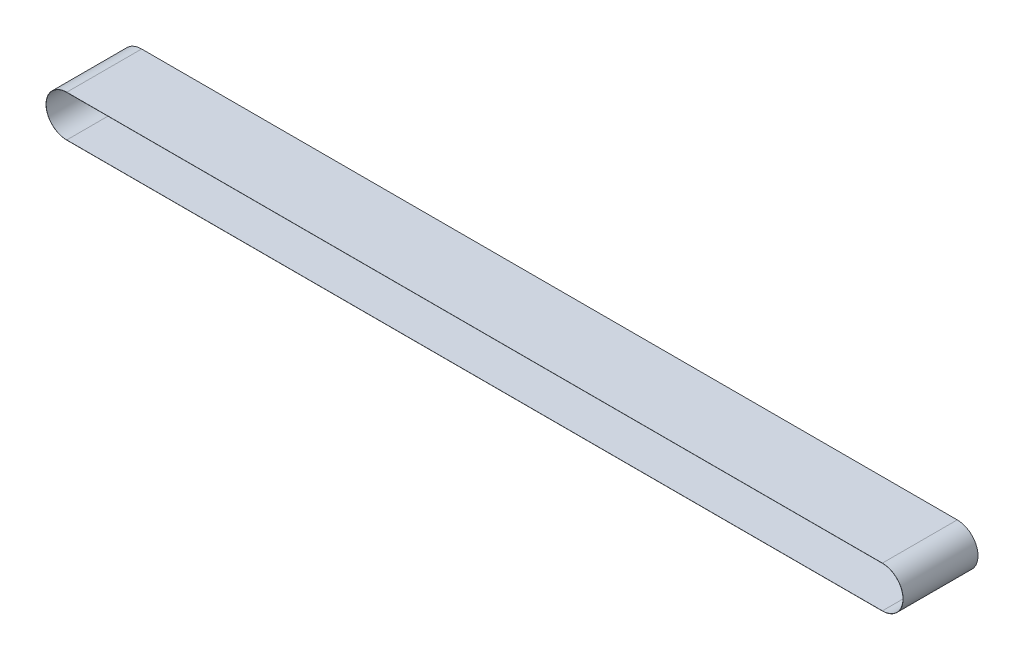
ISO-10303-21;
HEADER;
FILE_DESCRIPTION(('STEP AP214'),'2;1');
FILE_NAME('part.step','',(''),(''),'','','');
FILE_SCHEMA(('AUTOMOTIVE_DESIGN { 1 0 10303 214 1 1 1 1 }'));
ENDSEC;
DATA;
#1=APPLICATION_CONTEXT('core data for automotive mechanical design processes');
#2=APPLICATION_PROTOCOL_DEFINITION('international standard','automotive_design',2000,#1);
#3=PRODUCT_CONTEXT('',#1,'mechanical');
#4=PRODUCT('Part','Part','',(#3));
#5=PRODUCT_RELATED_PRODUCT_CATEGORY('part','',(#4));
#6=PRODUCT_DEFINITION_FORMATION('','',#4);
#7=PRODUCT_DEFINITION_CONTEXT('part definition',#1,'design');
#8=PRODUCT_DEFINITION('design','',#6,#7);
#9=PRODUCT_DEFINITION_SHAPE('','',#8);
#10=(LENGTH_UNIT() NAMED_UNIT(*) SI_UNIT(.MILLI.,.METRE.));
#11=(NAMED_UNIT(*) PLANE_ANGLE_UNIT() SI_UNIT($,.RADIAN.));
#12=(NAMED_UNIT(*) SI_UNIT($,.STERADIAN.) SOLID_ANGLE_UNIT());
#13=UNCERTAINTY_MEASURE_WITH_UNIT(LENGTH_MEASURE(1.E-05),#10,'distance_accuracy_value','');
#14=(GEOMETRIC_REPRESENTATION_CONTEXT(3) GLOBAL_UNCERTAINTY_ASSIGNED_CONTEXT((#13)) GLOBAL_UNIT_ASSIGNED_CONTEXT((#10,
#11,#12)) REPRESENTATION_CONTEXT('',''));
#15=CARTESIAN_POINT('',(0.,0.,0.));
#16=DIRECTION('',(0.,0.,1.));
#17=DIRECTION('',(1.,0.,0.));
#18=AXIS2_PLACEMENT_3D('',#15,#16,#17);
#19=CARTESIAN_POINT('',(272.300004366792,0.,-25.));
#20=DIRECTION('',(0.,0.,1.));
#21=DIRECTION('',(1.,0.,0.));
#22=AXIS2_PLACEMENT_3D('',#19,#20,#21);
#23=CYLINDRICAL_SURFACE('',#22,13.8550000000007);
#24=DIRECTION('',(0.,0.,1.));
#25=VECTOR('',#24,1.);
#26=CARTESIAN_POINT('',(272.3,13.855,-25.));
#27=LINE('',#26,#25);
#28=CARTESIAN_POINT('',(272.3,13.855,-25.));
#29=VERTEX_POINT('',#28);
#30=CARTESIAN_POINT('',(272.3,13.855,25.));
#31=VERTEX_POINT('',#30);
#32=EDGE_CURVE('E90',#29,#31,#27,.T.);
#33=ORIENTED_EDGE('',*,*,#32,.T.);
#34=CARTESIAN_POINT('',(272.300004366792,0.,25.));
#35=DIRECTION('',(0.,0.,1.));
#36=DIRECTION('',(1.,0.,0.));
#37=AXIS2_PLACEMENT_3D('',#34,#35,#36);
#38=CIRCLE('',#37,13.8550000000007);
#39=CARTESIAN_POINT('',(272.3,-13.855,25.));
#40=VERTEX_POINT('',#39);
#41=EDGE_CURVE('E182',#40,#31,#38,.T.);
#42=ORIENTED_EDGE('',*,*,#41,.F.);
#43=DIRECTION('',(0.,0.,1.));
#44=VECTOR('',#43,1.);
#45=CARTESIAN_POINT('',(272.3,-13.855,-25.));
#46=LINE('',#45,#44);
#47=CARTESIAN_POINT('',(272.3,-13.855,-25.));
#48=VERTEX_POINT('',#47);
#49=EDGE_CURVE('E12',#48,#40,#46,.T.);
#50=ORIENTED_EDGE('',*,*,#49,.F.);
#51=CARTESIAN_POINT('',(272.300004366792,0.,-25.));
#52=DIRECTION('',(0.,0.,1.));
#53=DIRECTION('',(1.,0.,0.));
#54=AXIS2_PLACEMENT_3D('',#51,#52,#53);
#55=CIRCLE('',#54,13.8550000000007);
#56=EDGE_CURVE('E201',#48,#29,#55,.T.);
#57=ORIENTED_EDGE('',*,*,#56,.T.);
#58=EDGE_LOOP('',(#33,#42,#50,#57));
#59=FACE_BOUND('',#58,.T.);
#60=ADVANCED_FACE('F87',(#59),#23,.T.);
#61=CARTESIAN_POINT('',(-272.3,-13.855,-25.));
#62=DIRECTION('',(0.,-1.,0.));
#63=DIRECTION('',(0.,0.,-1.));
#64=AXIS2_PLACEMENT_3D('',#61,#62,#63);
#65=PLANE('',#64);
#66=ORIENTED_EDGE('',*,*,#49,.T.);
#67=DIRECTION('',(1.,0.,0.));
#68=VECTOR('',#67,1.);
#69=CARTESIAN_POINT('',(-272.3,-13.855,25.));
#70=LINE('',#69,#68);
#71=CARTESIAN_POINT('',(-272.299999968253,-13.855,25.));
#72=VERTEX_POINT('',#71);
#73=EDGE_CURVE('E191',#72,#40,#70,.T.);
#74=ORIENTED_EDGE('',*,*,#73,.F.);
#75=DIRECTION('',(0.,0.,1.));
#76=VECTOR('',#75,1.);
#77=CARTESIAN_POINT('',(-272.299999968253,-13.855,-25.));
#78=LINE('',#77,#76);
#79=CARTESIAN_POINT('',(-272.299999968253,-13.855,-25.));
#80=VERTEX_POINT('',#79);
#81=EDGE_CURVE('E95',#80,#72,#78,.T.);
#82=ORIENTED_EDGE('',*,*,#81,.F.);
#83=DIRECTION('',(1.,0.,0.));
#84=VECTOR('',#83,1.);
#85=CARTESIAN_POINT('',(-272.3,-13.855,-25.));
#86=LINE('',#85,#84);
#87=EDGE_CURVE('E212',#80,#48,#86,.T.);
#88=ORIENTED_EDGE('',*,*,#87,.T.);
#89=EDGE_LOOP('',(#66,#74,#82,#88));
#90=FACE_BOUND('',#89,.T.);
#91=ADVANCED_FACE('F224',(#90),#65,.T.);
#92=CARTESIAN_POINT('',(-272.300004366792,0.,-25.));
#93=DIRECTION('',(0.,0.,1.));
#94=DIRECTION('',(1.,0.,0.));
#95=AXIS2_PLACEMENT_3D('',#92,#93,#94);
#96=CYLINDRICAL_SURFACE('',#95,13.8550000000007);
#97=ORIENTED_EDGE('',*,*,#81,.T.);
#98=CARTESIAN_POINT('',(-272.300004366792,0.,25.));
#99=DIRECTION('',(0.,0.,1.));
#100=DIRECTION('',(1.,0.,0.));
#101=AXIS2_PLACEMENT_3D('',#98,#99,#100);
#102=CIRCLE('',#101,13.8550000000007);
#103=CARTESIAN_POINT('',(-272.3,13.855,25.));
#104=VERTEX_POINT('',#103);
#105=EDGE_CURVE('E188',#104,#72,#102,.T.);
#106=ORIENTED_EDGE('',*,*,#105,.F.);
#107=DIRECTION('',(0.,0.,1.));
#108=VECTOR('',#107,1.);
#109=CARTESIAN_POINT('',(-272.3,13.855,-25.));
#110=LINE('',#109,#108);
#111=CARTESIAN_POINT('',(-272.3,13.855,-25.));
#112=VERTEX_POINT('',#111);
#113=EDGE_CURVE('E215',#112,#104,#110,.T.);
#114=ORIENTED_EDGE('',*,*,#113,.F.);
#115=CARTESIAN_POINT('',(-272.300004366792,0.,-25.));
#116=DIRECTION('',(0.,0.,1.));
#117=DIRECTION('',(1.,0.,0.));
#118=AXIS2_PLACEMENT_3D('',#115,#116,#117);
#119=CIRCLE('',#118,13.8550000000007);
#120=EDGE_CURVE('E209',#112,#80,#119,.T.);
#121=ORIENTED_EDGE('',*,*,#120,.T.);
#122=EDGE_LOOP('',(#97,#106,#114,#121));
#123=FACE_BOUND('',#122,.T.);
#124=ADVANCED_FACE('F230',(#123),#96,.T.);
#125=CARTESIAN_POINT('',(-272.3,13.855,-25.));
#126=DIRECTION('',(0.,1.,0.));
#127=DIRECTION('',(0.,0.,1.));
#128=AXIS2_PLACEMENT_3D('',#125,#126,#127);
#129=PLANE('',#128);
#130=ORIENTED_EDGE('',*,*,#113,.T.);
#131=DIRECTION('',(-1.,0.,0.));
#132=VECTOR('',#131,1.);
#133=CARTESIAN_POINT('',(-272.3,13.855,25.));
#134=LINE('',#133,#132);
#135=EDGE_CURVE('E185',#31,#104,#134,.T.);
#136=ORIENTED_EDGE('',*,*,#135,.F.);
#137=ORIENTED_EDGE('',*,*,#32,.F.);
#138=DIRECTION('',(-1.,0.,0.));
#139=VECTOR('',#138,1.);
#140=CARTESIAN_POINT('',(-272.3,13.855,-25.));
#141=LINE('',#140,#139);
#142=EDGE_CURVE('E206',#29,#112,#141,.T.);
#143=ORIENTED_EDGE('',*,*,#142,.T.);
#144=EDGE_LOOP('',(#130,#136,#137,#143));
#145=FACE_BOUND('',#144,.T.);
#146=ADVANCED_FACE('F219',(#145),#129,.T.);
#147=CARTESIAN_POINT('',(272.300004366792,0.,-25.));
#148=DIRECTION('',(0.,0.,1.));
#149=DIRECTION('',(1.,0.,0.));
#150=AXIS2_PLACEMENT_3D('',#147,#148,#149);
#151=PLANE('',#150);
#152=DIRECTION('',(1.,0.,0.));
#153=VECTOR('',#152,1.);
#154=CARTESIAN_POINT('',(-272.3,-13.755,-25.));
#155=LINE('',#154,#153);
#156=CARTESIAN_POINT('',(-272.3,-13.755,-25.));
#157=VERTEX_POINT('',#156);
#158=CARTESIAN_POINT('',(272.3,-13.755,-25.));
#159=VERTEX_POINT('',#158);
#160=EDGE_CURVE('E164',#157,#159,#155,.T.);
#161=ORIENTED_EDGE('',*,*,#160,.T.);
#162=CARTESIAN_POINT('',(272.300004366792,0.,-25.));
#163=DIRECTION('',(0.,0.,1.));
#164=DIRECTION('',(1.,0.,0.));
#165=AXIS2_PLACEMENT_3D('',#162,#163,#164);
#166=CIRCLE('',#165,13.7550000000007);
#167=CARTESIAN_POINT('',(272.3,13.755,-25.));
#168=VERTEX_POINT('',#167);
#169=EDGE_CURVE('E194',#159,#168,#166,.T.);
#170=ORIENTED_EDGE('',*,*,#169,.T.);
#171=DIRECTION('',(-1.,0.,0.));
#172=VECTOR('',#171,1.);
#173=CARTESIAN_POINT('',(-272.3,13.755,-25.));
#174=LINE('',#173,#172);
#175=CARTESIAN_POINT('',(-272.3,13.755,-25.));
#176=VERTEX_POINT('',#175);
#177=EDGE_CURVE('E159',#168,#176,#174,.T.);
#178=ORIENTED_EDGE('',*,*,#177,.T.);
#179=CARTESIAN_POINT('',(-272.300004366792,0.,-25.));
#180=DIRECTION('',(0.,0.,1.));
#181=DIRECTION('',(-1.,0.,0.));
#182=AXIS2_PLACEMENT_3D('',#179,#180,#181);
#183=CIRCLE('',#182,13.7550000000007);
#184=EDGE_CURVE('E103',#176,#157,#183,.T.);
#185=ORIENTED_EDGE('',*,*,#184,.T.);
#186=EDGE_LOOP('',(#161,#170,#178,#185));
#187=FACE_BOUND('',#186,.T.);
#188=ORIENTED_EDGE('',*,*,#56,.F.);
#189=ORIENTED_EDGE('',*,*,#87,.F.);
#190=ORIENTED_EDGE('',*,*,#120,.F.);
#191=ORIENTED_EDGE('',*,*,#142,.F.);
#192=EDGE_LOOP('',(#188,#189,#190,#191));
#193=FACE_BOUND('',#192,.T.);
#194=ADVANCED_FACE('F228',(#187,#193),#151,.F.);
#195=CARTESIAN_POINT('',(272.300004366792,0.,-25.));
#196=DIRECTION('',(0.,0.,1.));
#197=DIRECTION('',(1.,0.,0.));
#198=AXIS2_PLACEMENT_3D('',#195,#196,#197);
#199=CYLINDRICAL_SURFACE('',#198,13.7550000000007);
#200=DIRECTION('',(0.,0.,1.));
#201=VECTOR('',#200,1.);
#202=CARTESIAN_POINT('',(272.3,-13.755,-25.));
#203=LINE('',#202,#201);
#204=CARTESIAN_POINT('',(272.3,-13.755,25.));
#205=VERTEX_POINT('',#204);
#206=EDGE_CURVE('E169',#159,#205,#203,.T.);
#207=ORIENTED_EDGE('',*,*,#206,.T.);
#208=CARTESIAN_POINT('',(272.300004366792,0.,25.));
#209=DIRECTION('',(0.,0.,1.));
#210=DIRECTION('',(1.,0.,0.));
#211=AXIS2_PLACEMENT_3D('',#208,#209,#210);
#212=CIRCLE('',#211,13.7550000000007);
#213=CARTESIAN_POINT('',(272.3,13.755,25.));
#214=VERTEX_POINT('',#213);
#215=EDGE_CURVE('E167',#205,#214,#212,.T.);
#216=ORIENTED_EDGE('',*,*,#215,.T.);
#217=DIRECTION('',(0.,0.,1.));
#218=VECTOR('',#217,1.);
#219=CARTESIAN_POINT('',(272.3,13.755,-25.));
#220=LINE('',#219,#218);
#221=EDGE_CURVE('E152',#168,#214,#220,.T.);
#222=ORIENTED_EDGE('',*,*,#221,.F.);
#223=ORIENTED_EDGE('',*,*,#169,.F.);
#224=EDGE_LOOP('',(#207,#216,#222,#223));
#225=FACE_BOUND('',#224,.T.);
#226=ADVANCED_FACE('F168',(#225),#199,.F.);
#227=CARTESIAN_POINT('',(-272.3,-13.755,-25.));
#228=DIRECTION('',(0.,-1.,0.));
#229=DIRECTION('',(0.,0.,-1.));
#230=AXIS2_PLACEMENT_3D('',#227,#228,#229);
#231=PLANE('',#230);
#232=DIRECTION('',(0.,0.,1.));
#233=VECTOR('',#232,1.);
#234=CARTESIAN_POINT('',(-272.3,-13.755,-25.));
#235=LINE('',#234,#233);
#236=CARTESIAN_POINT('',(-272.3,-13.755,25.));
#237=VERTEX_POINT('',#236);
#238=EDGE_CURVE('E202',#157,#237,#235,.T.);
#239=ORIENTED_EDGE('',*,*,#238,.T.);
#240=DIRECTION('',(1.,0.,0.));
#241=VECTOR('',#240,1.);
#242=CARTESIAN_POINT('',(-272.3,-13.755,25.));
#243=LINE('',#242,#241);
#244=EDGE_CURVE('E178',#237,#205,#243,.T.);
#245=ORIENTED_EDGE('',*,*,#244,.T.);
#246=ORIENTED_EDGE('',*,*,#206,.F.);
#247=ORIENTED_EDGE('',*,*,#160,.F.);
#248=EDGE_LOOP('',(#239,#245,#246,#247));
#249=FACE_BOUND('',#248,.T.);
#250=ADVANCED_FACE('F275',(#249),#231,.F.);
#251=CARTESIAN_POINT('',(-272.300004366792,0.,-25.));
#252=DIRECTION('',(0.,0.,1.));
#253=DIRECTION('',(1.,0.,0.));
#254=AXIS2_PLACEMENT_3D('',#251,#252,#253);
#255=CYLINDRICAL_SURFACE('',#254,13.7550000000007);
#256=DIRECTION('',(0.,0.,1.));
#257=VECTOR('',#256,1.);
#258=CARTESIAN_POINT('',(-272.3,13.755,-25.));
#259=LINE('',#258,#257);
#260=CARTESIAN_POINT('',(-272.3,13.755,25.));
#261=VERTEX_POINT('',#260);
#262=EDGE_CURVE('E163',#176,#261,#259,.T.);
#263=ORIENTED_EDGE('',*,*,#262,.T.);
#264=CARTESIAN_POINT('',(-272.300004366792,0.,25.));
#265=DIRECTION('',(0.,0.,1.));
#266=DIRECTION('',(-1.,0.,0.));
#267=AXIS2_PLACEMENT_3D('',#264,#265,#266);
#268=CIRCLE('',#267,13.7550000000007);
#269=EDGE_CURVE('E176',#261,#237,#268,.T.);
#270=ORIENTED_EDGE('',*,*,#269,.T.);
#271=ORIENTED_EDGE('',*,*,#238,.F.);
#272=ORIENTED_EDGE('',*,*,#184,.F.);
#273=EDGE_LOOP('',(#263,#270,#271,#272));
#274=FACE_BOUND('',#273,.T.);
#275=ADVANCED_FACE('F284',(#274),#255,.F.);
#276=CARTESIAN_POINT('',(-272.3,13.755,-25.));
#277=DIRECTION('',(0.,1.,0.));
#278=DIRECTION('',(0.,0.,1.));
#279=AXIS2_PLACEMENT_3D('',#276,#277,#278);
#280=PLANE('',#279);
#281=ORIENTED_EDGE('',*,*,#221,.T.);
#282=DIRECTION('',(-1.,0.,0.));
#283=VECTOR('',#282,1.);
#284=CARTESIAN_POINT('',(-272.3,13.755,25.));
#285=LINE('',#284,#283);
#286=EDGE_CURVE('E156',#214,#261,#285,.T.);
#287=ORIENTED_EDGE('',*,*,#286,.T.);
#288=ORIENTED_EDGE('',*,*,#262,.F.);
#289=ORIENTED_EDGE('',*,*,#177,.F.);
#290=EDGE_LOOP('',(#281,#287,#288,#289));
#291=FACE_BOUND('',#290,.T.);
#292=ADVANCED_FACE('F154',(#291),#280,.F.);
#293=CARTESIAN_POINT('',(272.300004366792,0.,25.));
#294=DIRECTION('',(0.,0.,1.));
#295=DIRECTION('',(1.,0.,0.));
#296=AXIS2_PLACEMENT_3D('',#293,#294,#295);
#297=PLANE('',#296);
#298=ORIENTED_EDGE('',*,*,#41,.T.);
#299=ORIENTED_EDGE('',*,*,#135,.T.);
#300=ORIENTED_EDGE('',*,*,#105,.T.);
#301=ORIENTED_EDGE('',*,*,#73,.T.);
#302=EDGE_LOOP('',(#298,#299,#300,#301));
#303=FACE_BOUND('',#302,.T.);
#304=ORIENTED_EDGE('',*,*,#286,.F.);
#305=ORIENTED_EDGE('',*,*,#215,.F.);
#306=ORIENTED_EDGE('',*,*,#244,.F.);
#307=ORIENTED_EDGE('',*,*,#269,.F.);
#308=EDGE_LOOP('',(#304,#305,#306,#307));
#309=FACE_BOUND('',#308,.T.);
#310=ADVANCED_FACE('F174',(#303,#309),#297,.T.);
#311=CLOSED_SHELL('',(#60,#91,#124,#146,#194,#226,#250,#275,#292,#310));
#312=MANIFOLD_SOLID_BREP('B2',#311);
#313=ADVANCED_BREP_SHAPE_REPRESENTATION('',(#18,#312),#14);
#314=SHAPE_DEFINITION_REPRESENTATION(#9,#313);
ENDSEC;
END-ISO-10303-21;
